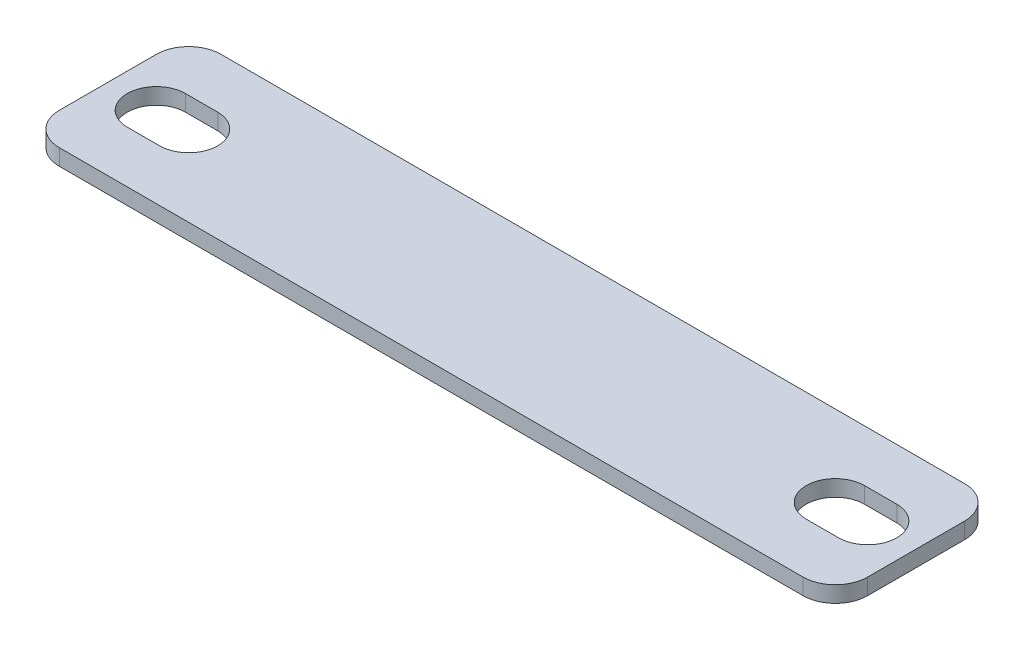
ISO-10303-21;
HEADER;
FILE_DESCRIPTION(('STEP AP214'),'2;1');
FILE_NAME('part.step','',(''),(''),'','','');
FILE_SCHEMA(('AUTOMOTIVE_DESIGN { 1 0 10303 214 1 1 1 1 }'));
ENDSEC;
DATA;
#1=APPLICATION_CONTEXT('core data for automotive mechanical design processes');
#2=APPLICATION_PROTOCOL_DEFINITION('international standard','automotive_design',2000,#1);
#3=PRODUCT_CONTEXT('',#1,'mechanical');
#4=PRODUCT('Part','Part','',(#3));
#5=PRODUCT_RELATED_PRODUCT_CATEGORY('part','',(#4));
#6=PRODUCT_DEFINITION_FORMATION('','',#4);
#7=PRODUCT_DEFINITION_CONTEXT('part definition',#1,'design');
#8=PRODUCT_DEFINITION('design','',#6,#7);
#9=PRODUCT_DEFINITION_SHAPE('','',#8);
#10=(LENGTH_UNIT() NAMED_UNIT(*) SI_UNIT(.MILLI.,.METRE.));
#11=(NAMED_UNIT(*) PLANE_ANGLE_UNIT() SI_UNIT($,.RADIAN.));
#12=(NAMED_UNIT(*) SI_UNIT($,.STERADIAN.) SOLID_ANGLE_UNIT());
#13=UNCERTAINTY_MEASURE_WITH_UNIT(LENGTH_MEASURE(1.E-05),#10,'distance_accuracy_value','');
#14=(GEOMETRIC_REPRESENTATION_CONTEXT(3) GLOBAL_UNCERTAINTY_ASSIGNED_CONTEXT((#13)) GLOBAL_UNIT_ASSIGNED_CONTEXT((#10,
#11,#12)) REPRESENTATION_CONTEXT('',''));
#15=CARTESIAN_POINT('',(0.,0.,0.));
#16=DIRECTION('',(0.,0.,1.));
#17=DIRECTION('',(1.,0.,0.));
#18=AXIS2_PLACEMENT_3D('',#15,#16,#17);
#19=CARTESIAN_POINT('',(0.,1.27,0.));
#20=DIRECTION('',(0.,-1.,0.));
#21=DIRECTION('',(0.,0.,-1.));
#22=AXIS2_PLACEMENT_3D('',#19,#20,#21);
#23=PLANE('',#22);
#24=CARTESIAN_POINT('',(-27.94,1.27,0.));
#25=DIRECTION('',(0.,1.,0.));
#26=DIRECTION('',(0.,0.,1.));
#27=AXIS2_PLACEMENT_3D('',#24,#25,#26);
#28=CIRCLE('',#27,2.286);
#29=CARTESIAN_POINT('',(-27.94,1.27,-2.286));
#30=VERTEX_POINT('',#29);
#31=CARTESIAN_POINT('',(-27.94,1.27,2.286));
#32=VERTEX_POINT('',#31);
#33=EDGE_CURVE('E215',#30,#32,#28,.T.);
#34=ORIENTED_EDGE('',*,*,#33,.F.);
#35=DIRECTION('',(-1.,0.,0.));
#36=VECTOR('',#35,1.);
#37=CARTESIAN_POINT('',(-27.94,1.27,-2.286));
#38=LINE('',#37,#36);
#39=CARTESIAN_POINT('',(-25.4,1.27,-2.286));
#40=VERTEX_POINT('',#39);
#41=EDGE_CURVE('E220',#40,#30,#38,.T.);
#42=ORIENTED_EDGE('',*,*,#41,.F.);
#43=CARTESIAN_POINT('',(-25.4,1.27,0.));
#44=DIRECTION('',(0.,1.,0.));
#45=DIRECTION('',(0.,0.,1.));
#46=AXIS2_PLACEMENT_3D('',#43,#44,#45);
#47=CIRCLE('',#46,2.286);
#48=CARTESIAN_POINT('',(-25.4,1.27,2.286));
#49=VERTEX_POINT('',#48);
#50=EDGE_CURVE('E214',#49,#40,#47,.T.);
#51=ORIENTED_EDGE('',*,*,#50,.F.);
#52=DIRECTION('',(1.,0.,0.));
#53=VECTOR('',#52,1.);
#54=CARTESIAN_POINT('',(-27.94,1.27,2.286));
#55=LINE('',#54,#53);
#56=EDGE_CURVE('E211',#32,#49,#55,.T.);
#57=ORIENTED_EDGE('',*,*,#56,.F.);
#58=EDGE_LOOP('',(#34,#42,#51,#57));
#59=FACE_BOUND('',#58,.T.);
#60=DIRECTION('',(0.,0.,-1.));
#61=VECTOR('',#60,1.);
#62=CARTESIAN_POINT('',(31.75,1.27,6.35));
#63=LINE('',#62,#61);
#64=CARTESIAN_POINT('',(31.75,1.27,3.81));
#65=VERTEX_POINT('',#64);
#66=CARTESIAN_POINT('',(31.75,1.27,-3.81));
#67=VERTEX_POINT('',#66);
#68=EDGE_CURVE('E195',#65,#67,#63,.T.);
#69=ORIENTED_EDGE('',*,*,#68,.T.);
#70=CARTESIAN_POINT('',(29.21,1.27,-3.81));
#71=DIRECTION('',(0.,-1.,0.));
#72=DIRECTION('',(0.,0.,-1.));
#73=AXIS2_PLACEMENT_3D('',#70,#71,#72);
#74=CIRCLE('',#73,2.54);
#75=CARTESIAN_POINT('',(29.21,1.27,-6.35));
#76=VERTEX_POINT('',#75);
#77=EDGE_CURVE('E282',#67,#76,#74,.F.);
#78=ORIENTED_EDGE('',*,*,#77,.T.);
#79=DIRECTION('',(-1.,0.,0.));
#80=VECTOR('',#79,1.);
#81=CARTESIAN_POINT('',(-31.75,1.27,-6.35));
#82=LINE('',#81,#80);
#83=CARTESIAN_POINT('',(-29.21,1.27,-6.35));
#84=VERTEX_POINT('',#83);
#85=EDGE_CURVE('E202',#76,#84,#82,.T.);
#86=ORIENTED_EDGE('',*,*,#85,.T.);
#87=CARTESIAN_POINT('',(-29.21,1.27,-3.81));
#88=DIRECTION('',(0.,-1.,0.));
#89=DIRECTION('',(0.,0.,-1.));
#90=AXIS2_PLACEMENT_3D('',#87,#88,#89);
#91=CIRCLE('',#90,2.54);
#92=CARTESIAN_POINT('',(-31.75,1.27,-3.81));
#93=VERTEX_POINT('',#92);
#94=EDGE_CURVE('E278',#84,#93,#91,.F.);
#95=ORIENTED_EDGE('',*,*,#94,.T.);
#96=DIRECTION('',(0.,0.,1.));
#97=VECTOR('',#96,1.);
#98=CARTESIAN_POINT('',(-31.75,1.27,6.35));
#99=LINE('',#98,#97);
#100=CARTESIAN_POINT('',(-31.75,1.27,3.81));
#101=VERTEX_POINT('',#100);
#102=EDGE_CURVE('E196',#93,#101,#99,.T.);
#103=ORIENTED_EDGE('',*,*,#102,.T.);
#104=CARTESIAN_POINT('',(-29.21,1.27,3.81));
#105=DIRECTION('',(0.,-1.,0.));
#106=DIRECTION('',(0.,0.,-1.));
#107=AXIS2_PLACEMENT_3D('',#104,#105,#106);
#108=CIRCLE('',#107,2.54);
#109=CARTESIAN_POINT('',(-29.21,1.27,6.35));
#110=VERTEX_POINT('',#109);
#111=EDGE_CURVE('E59',#101,#110,#108,.F.);
#112=ORIENTED_EDGE('',*,*,#111,.T.);
#113=DIRECTION('',(1.,0.,0.));
#114=VECTOR('',#113,1.);
#115=CARTESIAN_POINT('',(-31.75,1.27,6.35));
#116=LINE('',#115,#114);
#117=CARTESIAN_POINT('',(29.21,1.27,6.35));
#118=VERTEX_POINT('',#117);
#119=EDGE_CURVE('E192',#110,#118,#116,.T.);
#120=ORIENTED_EDGE('',*,*,#119,.T.);
#121=CARTESIAN_POINT('',(29.21,1.27,3.81));
#122=DIRECTION('',(0.,-1.,0.));
#123=DIRECTION('',(0.,0.,-1.));
#124=AXIS2_PLACEMENT_3D('',#121,#122,#123);
#125=CIRCLE('',#124,2.54);
#126=EDGE_CURVE('E280',#118,#65,#125,.F.);
#127=ORIENTED_EDGE('',*,*,#126,.T.);
#128=EDGE_LOOP('',(#69,#78,#86,#95,#103,#112,#120,#127));
#129=FACE_BOUND('',#128,.T.);
#130=CARTESIAN_POINT('',(25.4,1.27,0.));
#131=DIRECTION('',(0.,1.,0.));
#132=DIRECTION('',(0.,0.,1.));
#133=AXIS2_PLACEMENT_3D('',#130,#131,#132);
#134=CIRCLE('',#133,2.286);
#135=CARTESIAN_POINT('',(25.4,1.27,-2.286));
#136=VERTEX_POINT('',#135);
#137=CARTESIAN_POINT('',(25.4,1.27,2.286));
#138=VERTEX_POINT('',#137);
#139=EDGE_CURVE('E153',#136,#138,#134,.T.);
#140=ORIENTED_EDGE('',*,*,#139,.F.);
#141=DIRECTION('',(-1.,0.,0.));
#142=VECTOR('',#141,1.);
#143=CARTESIAN_POINT('',(25.4,1.27,-2.286));
#144=LINE('',#143,#142);
#145=CARTESIAN_POINT('',(27.94,1.27,-2.286));
#146=VERTEX_POINT('',#145);
#147=EDGE_CURVE('E177',#146,#136,#144,.T.);
#148=ORIENTED_EDGE('',*,*,#147,.F.);
#149=CARTESIAN_POINT('',(27.94,1.27,0.));
#150=DIRECTION('',(0.,1.,0.));
#151=DIRECTION('',(0.,0.,1.));
#152=AXIS2_PLACEMENT_3D('',#149,#150,#151);
#153=CIRCLE('',#152,2.286);
#154=CARTESIAN_POINT('',(27.94,1.27,2.286));
#155=VERTEX_POINT('',#154);
#156=EDGE_CURVE('E176',#155,#146,#153,.T.);
#157=ORIENTED_EDGE('',*,*,#156,.F.);
#158=DIRECTION('',(1.,0.,0.));
#159=VECTOR('',#158,1.);
#160=CARTESIAN_POINT('',(25.4,1.27,2.286));
#161=LINE('',#160,#159);
#162=EDGE_CURVE('E163',#138,#155,#161,.T.);
#163=ORIENTED_EDGE('',*,*,#162,.F.);
#164=EDGE_LOOP('',(#140,#148,#157,#163));
#165=FACE_BOUND('',#164,.T.);
#166=ADVANCED_FACE('F37',(#59,#129,#165),#23,.F.);
#167=CARTESIAN_POINT('',(0.,0.,0.));
#168=DIRECTION('',(0.,-1.,0.));
#169=DIRECTION('',(0.,0.,-1.));
#170=AXIS2_PLACEMENT_3D('',#167,#168,#169);
#171=PLANE('',#170);
#172=DIRECTION('',(-1.,0.,0.));
#173=VECTOR('',#172,1.);
#174=CARTESIAN_POINT('',(-31.75,0.,-6.35));
#175=LINE('',#174,#173);
#176=CARTESIAN_POINT('',(29.21,0.,-6.35));
#177=VERTEX_POINT('',#176);
#178=CARTESIAN_POINT('',(-29.21,0.,-6.35));
#179=VERTEX_POINT('',#178);
#180=EDGE_CURVE('E256',#177,#179,#175,.T.);
#181=ORIENTED_EDGE('',*,*,#180,.F.);
#182=CARTESIAN_POINT('',(29.21,0.,-3.81));
#183=DIRECTION('',(0.,-1.,0.));
#184=DIRECTION('',(0.,0.,-1.));
#185=AXIS2_PLACEMENT_3D('',#182,#183,#184);
#186=CIRCLE('',#185,2.54);
#187=CARTESIAN_POINT('',(31.75,0.,-3.81));
#188=VERTEX_POINT('',#187);
#189=EDGE_CURVE('E270',#177,#188,#186,.T.);
#190=ORIENTED_EDGE('',*,*,#189,.T.);
#191=DIRECTION('',(0.,0.,-1.));
#192=VECTOR('',#191,1.);
#193=CARTESIAN_POINT('',(31.75,0.,6.35));
#194=LINE('',#193,#192);
#195=CARTESIAN_POINT('',(31.75,0.,3.81));
#196=VERTEX_POINT('',#195);
#197=EDGE_CURVE('E251',#196,#188,#194,.T.);
#198=ORIENTED_EDGE('',*,*,#197,.F.);
#199=CARTESIAN_POINT('',(29.21,0.,3.81));
#200=DIRECTION('',(0.,-1.,0.));
#201=DIRECTION('',(0.,0.,-1.));
#202=AXIS2_PLACEMENT_3D('',#199,#200,#201);
#203=CIRCLE('',#202,2.54);
#204=CARTESIAN_POINT('',(29.21,0.,6.35));
#205=VERTEX_POINT('',#204);
#206=EDGE_CURVE('E268',#196,#205,#203,.T.);
#207=ORIENTED_EDGE('',*,*,#206,.T.);
#208=DIRECTION('',(1.,0.,0.));
#209=VECTOR('',#208,1.);
#210=CARTESIAN_POINT('',(-31.75,0.,6.35));
#211=LINE('',#210,#209);
#212=CARTESIAN_POINT('',(-29.21,0.,6.35));
#213=VERTEX_POINT('',#212);
#214=EDGE_CURVE('E247',#213,#205,#211,.T.);
#215=ORIENTED_EDGE('',*,*,#214,.F.);
#216=CARTESIAN_POINT('',(-29.21,0.,3.81));
#217=DIRECTION('',(0.,-1.,0.));
#218=DIRECTION('',(0.,0.,-1.));
#219=AXIS2_PLACEMENT_3D('',#216,#217,#218);
#220=CIRCLE('',#219,2.54);
#221=CARTESIAN_POINT('',(-31.75,0.,3.81));
#222=VERTEX_POINT('',#221);
#223=EDGE_CURVE('E264',#213,#222,#220,.T.);
#224=ORIENTED_EDGE('',*,*,#223,.T.);
#225=DIRECTION('',(0.,0.,1.));
#226=VECTOR('',#225,1.);
#227=CARTESIAN_POINT('',(-31.75,0.,6.35));
#228=LINE('',#227,#226);
#229=CARTESIAN_POINT('',(-31.75,0.,-3.81));
#230=VERTEX_POINT('',#229);
#231=EDGE_CURVE('E243',#230,#222,#228,.T.);
#232=ORIENTED_EDGE('',*,*,#231,.F.);
#233=CARTESIAN_POINT('',(-29.21,0.,-3.81));
#234=DIRECTION('',(0.,-1.,0.));
#235=DIRECTION('',(0.,0.,-1.));
#236=AXIS2_PLACEMENT_3D('',#233,#234,#235);
#237=CIRCLE('',#236,2.54);
#238=EDGE_CURVE('E266',#230,#179,#237,.T.);
#239=ORIENTED_EDGE('',*,*,#238,.T.);
#240=EDGE_LOOP('',(#181,#190,#198,#207,#215,#224,#232,#239));
#241=FACE_BOUND('',#240,.T.);
#242=DIRECTION('',(-1.,0.,0.));
#243=VECTOR('',#242,1.);
#244=CARTESIAN_POINT('',(-27.94,0.,-2.286));
#245=LINE('',#244,#243);
#246=CARTESIAN_POINT('',(-25.4,0.,-2.286));
#247=VERTEX_POINT('',#246);
#248=CARTESIAN_POINT('',(-27.94,0.,-2.286));
#249=VERTEX_POINT('',#248);
#250=EDGE_CURVE('E233',#247,#249,#245,.T.);
#251=ORIENTED_EDGE('',*,*,#250,.T.);
#252=CARTESIAN_POINT('',(-27.94,0.,0.));
#253=DIRECTION('',(0.,1.,0.));
#254=DIRECTION('',(0.,0.,1.));
#255=AXIS2_PLACEMENT_3D('',#252,#253,#254);
#256=CIRCLE('',#255,2.286);
#257=CARTESIAN_POINT('',(-27.94,0.,2.286));
#258=VERTEX_POINT('',#257);
#259=EDGE_CURVE('E171',#249,#258,#256,.T.);
#260=ORIENTED_EDGE('',*,*,#259,.T.);
#261=DIRECTION('',(1.,0.,0.));
#262=VECTOR('',#261,1.);
#263=CARTESIAN_POINT('',(-27.94,0.,2.286));
#264=LINE('',#263,#262);
#265=CARTESIAN_POINT('',(-25.4,0.,2.286));
#266=VERTEX_POINT('',#265);
#267=EDGE_CURVE('E227',#258,#266,#264,.T.);
#268=ORIENTED_EDGE('',*,*,#267,.T.);
#269=CARTESIAN_POINT('',(-25.4,0.,0.));
#270=DIRECTION('',(0.,1.,0.));
#271=DIRECTION('',(0.,0.,1.));
#272=AXIS2_PLACEMENT_3D('',#269,#270,#271);
#273=CIRCLE('',#272,2.286);
#274=EDGE_CURVE('E230',#266,#247,#273,.T.);
#275=ORIENTED_EDGE('',*,*,#274,.T.);
#276=EDGE_LOOP('',(#251,#260,#268,#275));
#277=FACE_BOUND('',#276,.T.);
#278=DIRECTION('',(-1.,0.,0.));
#279=VECTOR('',#278,1.);
#280=CARTESIAN_POINT('',(25.4,0.,-2.286));
#281=LINE('',#280,#279);
#282=CARTESIAN_POINT('',(27.94,0.,-2.286));
#283=VERTEX_POINT('',#282);
#284=CARTESIAN_POINT('',(25.4,0.,-2.286));
#285=VERTEX_POINT('',#284);
#286=EDGE_CURVE('E164',#283,#285,#281,.T.);
#287=ORIENTED_EDGE('',*,*,#286,.T.);
#288=CARTESIAN_POINT('',(25.4,0.,0.));
#289=DIRECTION('',(0.,1.,0.));
#290=DIRECTION('',(0.,0.,1.));
#291=AXIS2_PLACEMENT_3D('',#288,#289,#290);
#292=CIRCLE('',#291,2.286);
#293=CARTESIAN_POINT('',(25.4,0.,2.286));
#294=VERTEX_POINT('',#293);
#295=EDGE_CURVE('E387',#285,#294,#292,.T.);
#296=ORIENTED_EDGE('',*,*,#295,.T.);
#297=DIRECTION('',(1.,0.,0.));
#298=VECTOR('',#297,1.);
#299=CARTESIAN_POINT('',(25.4,0.,2.286));
#300=LINE('',#299,#298);
#301=CARTESIAN_POINT('',(27.94,0.,2.286));
#302=VERTEX_POINT('',#301);
#303=EDGE_CURVE('E170',#294,#302,#300,.T.);
#304=ORIENTED_EDGE('',*,*,#303,.T.);
#305=CARTESIAN_POINT('',(27.94,0.,0.));
#306=DIRECTION('',(0.,1.,0.));
#307=DIRECTION('',(0.,0.,1.));
#308=AXIS2_PLACEMENT_3D('',#305,#306,#307);
#309=CIRCLE('',#308,2.286);
#310=EDGE_CURVE('E389',#302,#283,#309,.T.);
#311=ORIENTED_EDGE('',*,*,#310,.T.);
#312=EDGE_LOOP('',(#287,#296,#304,#311));
#313=FACE_BOUND('',#312,.T.);
#314=ADVANCED_FACE('F298',(#241,#277,#313),#171,.T.);
#315=CARTESIAN_POINT('',(-31.75,1.27,6.35));
#316=DIRECTION('',(1.,0.,0.));
#317=DIRECTION('',(0.,0.,-1.));
#318=AXIS2_PLACEMENT_3D('',#315,#316,#317);
#319=PLANE('',#318);
#320=ORIENTED_EDGE('',*,*,#102,.F.);
#321=DIRECTION('',(0.,-1.,0.));
#322=VECTOR('',#321,1.);
#323=CARTESIAN_POINT('',(-31.75,1.27,-3.81));
#324=LINE('',#323,#322);
#325=EDGE_CURVE('E12',#93,#230,#324,.T.);
#326=ORIENTED_EDGE('',*,*,#325,.T.);
#327=ORIENTED_EDGE('',*,*,#231,.T.);
#328=DIRECTION('',(0.,-1.,0.));
#329=VECTOR('',#328,1.);
#330=CARTESIAN_POINT('',(-31.75,1.27,3.81));
#331=LINE('',#330,#329);
#332=EDGE_CURVE('E45',#222,#101,#331,.F.);
#333=ORIENTED_EDGE('',*,*,#332,.T.);
#334=EDGE_LOOP('',(#320,#326,#327,#333));
#335=FACE_BOUND('',#334,.T.);
#336=ADVANCED_FACE('F288',(#335),#319,.F.);
#337=CARTESIAN_POINT('',(-31.75,1.27,6.35));
#338=DIRECTION('',(0.,0.,-1.));
#339=DIRECTION('',(-1.,0.,0.));
#340=AXIS2_PLACEMENT_3D('',#337,#338,#339);
#341=PLANE('',#340);
#342=ORIENTED_EDGE('',*,*,#214,.T.);
#343=DIRECTION('',(0.,-1.,0.));
#344=VECTOR('',#343,1.);
#345=CARTESIAN_POINT('',(29.21,1.27,6.35));
#346=LINE('',#345,#344);
#347=EDGE_CURVE('E52',#205,#118,#346,.F.);
#348=ORIENTED_EDGE('',*,*,#347,.T.);
#349=ORIENTED_EDGE('',*,*,#119,.F.);
#350=DIRECTION('',(0.,-1.,0.));
#351=VECTOR('',#350,1.);
#352=CARTESIAN_POINT('',(-29.21,1.27,6.35));
#353=LINE('',#352,#351);
#354=EDGE_CURVE('E284',#110,#213,#353,.T.);
#355=ORIENTED_EDGE('',*,*,#354,.T.);
#356=EDGE_LOOP('',(#342,#348,#349,#355));
#357=FACE_BOUND('',#356,.T.);
#358=ADVANCED_FACE('F295',(#357),#341,.F.);
#359=CARTESIAN_POINT('',(31.75,1.27,6.35));
#360=DIRECTION('',(-1.,0.,0.));
#361=DIRECTION('',(0.,0.,1.));
#362=AXIS2_PLACEMENT_3D('',#359,#360,#361);
#363=PLANE('',#362);
#364=ORIENTED_EDGE('',*,*,#197,.T.);
#365=DIRECTION('',(0.,-1.,0.));
#366=VECTOR('',#365,1.);
#367=CARTESIAN_POINT('',(31.75,1.27,-3.81));
#368=LINE('',#367,#366);
#369=EDGE_CURVE('E275',#188,#67,#368,.F.);
#370=ORIENTED_EDGE('',*,*,#369,.T.);
#371=ORIENTED_EDGE('',*,*,#68,.F.);
#372=DIRECTION('',(0.,-1.,0.));
#373=VECTOR('',#372,1.);
#374=CARTESIAN_POINT('',(31.75,1.27,3.81));
#375=LINE('',#374,#373);
#376=EDGE_CURVE('E272',#65,#196,#375,.T.);
#377=ORIENTED_EDGE('',*,*,#376,.T.);
#378=EDGE_LOOP('',(#364,#370,#371,#377));
#379=FACE_BOUND('',#378,.T.);
#380=ADVANCED_FACE('F307',(#379),#363,.F.);
#381=CARTESIAN_POINT('',(-31.75,1.27,-6.35));
#382=DIRECTION('',(0.,0.,1.));
#383=DIRECTION('',(1.,0.,0.));
#384=AXIS2_PLACEMENT_3D('',#381,#382,#383);
#385=PLANE('',#384);
#386=ORIENTED_EDGE('',*,*,#85,.F.);
#387=DIRECTION('',(0.,-1.,0.));
#388=VECTOR('',#387,1.);
#389=CARTESIAN_POINT('',(29.21,1.27,-6.35));
#390=LINE('',#389,#388);
#391=EDGE_CURVE('E261',#76,#177,#390,.T.);
#392=ORIENTED_EDGE('',*,*,#391,.T.);
#393=ORIENTED_EDGE('',*,*,#180,.T.);
#394=DIRECTION('',(0.,-1.,0.));
#395=VECTOR('',#394,1.);
#396=CARTESIAN_POINT('',(-29.21,1.27,-6.35));
#397=LINE('',#396,#395);
#398=EDGE_CURVE('E259',#179,#84,#397,.F.);
#399=ORIENTED_EDGE('',*,*,#398,.T.);
#400=EDGE_LOOP('',(#386,#392,#393,#399));
#401=FACE_BOUND('',#400,.T.);
#402=ADVANCED_FACE('F315',(#401),#385,.F.);
#403=CARTESIAN_POINT('',(-27.94,1.27,0.));
#404=DIRECTION('',(0.,-1.,0.));
#405=DIRECTION('',(0.,0.,-1.));
#406=AXIS2_PLACEMENT_3D('',#403,#404,#405);
#407=CYLINDRICAL_SURFACE('',#406,2.286);
#408=ORIENTED_EDGE('',*,*,#259,.F.);
#409=DIRECTION('',(0.,-1.,0.));
#410=VECTOR('',#409,1.);
#411=CARTESIAN_POINT('',(-27.94,1.27,-2.286));
#412=LINE('',#411,#410);
#413=EDGE_CURVE('E223',#30,#249,#412,.T.);
#414=ORIENTED_EDGE('',*,*,#413,.F.);
#415=ORIENTED_EDGE('',*,*,#33,.T.);
#416=DIRECTION('',(0.,-1.,0.));
#417=VECTOR('',#416,1.);
#418=CARTESIAN_POINT('',(-27.94,1.27,2.286));
#419=LINE('',#418,#417);
#420=EDGE_CURVE('E241',#32,#258,#419,.T.);
#421=ORIENTED_EDGE('',*,*,#420,.T.);
#422=EDGE_LOOP('',(#408,#414,#415,#421));
#423=FACE_BOUND('',#422,.T.);
#424=ADVANCED_FACE('F334',(#423),#407,.F.);
#425=CARTESIAN_POINT('',(-27.94,1.27,2.286));
#426=DIRECTION('',(0.,0.,-1.));
#427=DIRECTION('',(-1.,0.,0.));
#428=AXIS2_PLACEMENT_3D('',#425,#426,#427);
#429=PLANE('',#428);
#430=ORIENTED_EDGE('',*,*,#267,.F.);
#431=ORIENTED_EDGE('',*,*,#420,.F.);
#432=ORIENTED_EDGE('',*,*,#56,.T.);
#433=DIRECTION('',(0.,-1.,0.));
#434=VECTOR('',#433,1.);
#435=CARTESIAN_POINT('',(-25.4,1.27,2.286));
#436=LINE('',#435,#434);
#437=EDGE_CURVE('E240',#49,#266,#436,.T.);
#438=ORIENTED_EDGE('',*,*,#437,.T.);
#439=EDGE_LOOP('',(#430,#431,#432,#438));
#440=FACE_BOUND('',#439,.T.);
#441=ADVANCED_FACE('F370',(#440),#429,.T.);
#442=CARTESIAN_POINT('',(-25.4,1.27,0.));
#443=DIRECTION('',(0.,-1.,0.));
#444=DIRECTION('',(0.,0.,-1.));
#445=AXIS2_PLACEMENT_3D('',#442,#443,#444);
#446=CYLINDRICAL_SURFACE('',#445,2.286);
#447=ORIENTED_EDGE('',*,*,#274,.F.);
#448=ORIENTED_EDGE('',*,*,#437,.F.);
#449=ORIENTED_EDGE('',*,*,#50,.T.);
#450=DIRECTION('',(0.,-1.,0.));
#451=VECTOR('',#450,1.);
#452=CARTESIAN_POINT('',(-25.4,1.27,-2.286));
#453=LINE('',#452,#451);
#454=EDGE_CURVE('E238',#40,#247,#453,.T.);
#455=ORIENTED_EDGE('',*,*,#454,.T.);
#456=EDGE_LOOP('',(#447,#448,#449,#455));
#457=FACE_BOUND('',#456,.T.);
#458=ADVANCED_FACE('F367',(#457),#446,.F.);
#459=CARTESIAN_POINT('',(-27.94,1.27,-2.286));
#460=DIRECTION('',(0.,0.,1.));
#461=DIRECTION('',(1.,0.,0.));
#462=AXIS2_PLACEMENT_3D('',#459,#460,#461);
#463=PLANE('',#462);
#464=ORIENTED_EDGE('',*,*,#250,.F.);
#465=ORIENTED_EDGE('',*,*,#454,.F.);
#466=ORIENTED_EDGE('',*,*,#41,.T.);
#467=ORIENTED_EDGE('',*,*,#413,.T.);
#468=EDGE_LOOP('',(#464,#465,#466,#467));
#469=FACE_BOUND('',#468,.T.);
#470=ADVANCED_FACE('F364',(#469),#463,.T.);
#471=CARTESIAN_POINT('',(25.4,1.27,0.));
#472=DIRECTION('',(0.,-1.,0.));
#473=DIRECTION('',(0.,0.,-1.));
#474=AXIS2_PLACEMENT_3D('',#471,#472,#473);
#475=CYLINDRICAL_SURFACE('',#474,2.286);
#476=ORIENTED_EDGE('',*,*,#295,.F.);
#477=DIRECTION('',(0.,-1.,0.));
#478=VECTOR('',#477,1.);
#479=CARTESIAN_POINT('',(25.4,1.27,-2.286));
#480=LINE('',#479,#478);
#481=EDGE_CURVE('E159',#136,#285,#480,.T.);
#482=ORIENTED_EDGE('',*,*,#481,.F.);
#483=ORIENTED_EDGE('',*,*,#139,.T.);
#484=DIRECTION('',(0.,-1.,0.));
#485=VECTOR('',#484,1.);
#486=CARTESIAN_POINT('',(25.4,1.27,2.286));
#487=LINE('',#486,#485);
#488=EDGE_CURVE('E156',#138,#294,#487,.T.);
#489=ORIENTED_EDGE('',*,*,#488,.T.);
#490=EDGE_LOOP('',(#476,#482,#483,#489));
#491=FACE_BOUND('',#490,.T.);
#492=ADVANCED_FACE('F155',(#491),#475,.F.);
#493=CARTESIAN_POINT('',(25.4,1.27,2.286));
#494=DIRECTION('',(0.,0.,-1.));
#495=DIRECTION('',(-1.,0.,0.));
#496=AXIS2_PLACEMENT_3D('',#493,#494,#495);
#497=PLANE('',#496);
#498=ORIENTED_EDGE('',*,*,#303,.F.);
#499=ORIENTED_EDGE('',*,*,#488,.F.);
#500=ORIENTED_EDGE('',*,*,#162,.T.);
#501=DIRECTION('',(0.,-1.,0.));
#502=VECTOR('',#501,1.);
#503=CARTESIAN_POINT('',(27.94,1.27,2.286));
#504=LINE('',#503,#502);
#505=EDGE_CURVE('E172',#155,#302,#504,.T.);
#506=ORIENTED_EDGE('',*,*,#505,.T.);
#507=EDGE_LOOP('',(#498,#499,#500,#506));
#508=FACE_BOUND('',#507,.T.);
#509=ADVANCED_FACE('F167',(#508),#497,.T.);
#510=CARTESIAN_POINT('',(27.94,1.27,0.));
#511=DIRECTION('',(0.,-1.,0.));
#512=DIRECTION('',(0.,0.,-1.));
#513=AXIS2_PLACEMENT_3D('',#510,#511,#512);
#514=CYLINDRICAL_SURFACE('',#513,2.286);
#515=ORIENTED_EDGE('',*,*,#310,.F.);
#516=ORIENTED_EDGE('',*,*,#505,.F.);
#517=ORIENTED_EDGE('',*,*,#156,.T.);
#518=DIRECTION('',(0.,-1.,0.));
#519=VECTOR('',#518,1.);
#520=CARTESIAN_POINT('',(27.94,1.27,-2.286));
#521=LINE('',#520,#519);
#522=EDGE_CURVE('E395',#146,#283,#521,.T.);
#523=ORIENTED_EDGE('',*,*,#522,.T.);
#524=EDGE_LOOP('',(#515,#516,#517,#523));
#525=FACE_BOUND('',#524,.T.);
#526=ADVANCED_FACE('F350',(#525),#514,.F.);
#527=CARTESIAN_POINT('',(25.4,1.27,-2.286));
#528=DIRECTION('',(0.,0.,1.));
#529=DIRECTION('',(1.,0.,0.));
#530=AXIS2_PLACEMENT_3D('',#527,#528,#529);
#531=PLANE('',#530);
#532=ORIENTED_EDGE('',*,*,#286,.F.);
#533=ORIENTED_EDGE('',*,*,#522,.F.);
#534=ORIENTED_EDGE('',*,*,#147,.T.);
#535=ORIENTED_EDGE('',*,*,#481,.T.);
#536=EDGE_LOOP('',(#532,#533,#534,#535));
#537=FACE_BOUND('',#536,.T.);
#538=ADVANCED_FACE('F346',(#537),#531,.T.);
#539=CARTESIAN_POINT('',(29.21,1.27,-3.81));
#540=DIRECTION('',(0.,-1.,0.));
#541=DIRECTION('',(0.,0.,-1.));
#542=AXIS2_PLACEMENT_3D('',#539,#540,#541);
#543=CYLINDRICAL_SURFACE('',#542,2.54);
#544=ORIENTED_EDGE('',*,*,#77,.F.);
#545=ORIENTED_EDGE('',*,*,#369,.F.);
#546=ORIENTED_EDGE('',*,*,#189,.F.);
#547=ORIENTED_EDGE('',*,*,#391,.F.);
#548=EDGE_LOOP('',(#544,#545,#546,#547));
#549=FACE_BOUND('',#548,.T.);
#550=ADVANCED_FACE('F313',(#549),#543,.T.);
#551=CARTESIAN_POINT('',(29.21,1.27,3.81));
#552=DIRECTION('',(0.,-1.,0.));
#553=DIRECTION('',(0.,0.,-1.));
#554=AXIS2_PLACEMENT_3D('',#551,#552,#553);
#555=CYLINDRICAL_SURFACE('',#554,2.54);
#556=ORIENTED_EDGE('',*,*,#126,.F.);
#557=ORIENTED_EDGE('',*,*,#347,.F.);
#558=ORIENTED_EDGE('',*,*,#206,.F.);
#559=ORIENTED_EDGE('',*,*,#376,.F.);
#560=EDGE_LOOP('',(#556,#557,#558,#559));
#561=FACE_BOUND('',#560,.T.);
#562=ADVANCED_FACE('F304',(#561),#555,.T.);
#563=CARTESIAN_POINT('',(-29.21,1.27,-3.81));
#564=DIRECTION('',(0.,-1.,0.));
#565=DIRECTION('',(0.,0.,-1.));
#566=AXIS2_PLACEMENT_3D('',#563,#564,#565);
#567=CYLINDRICAL_SURFACE('',#566,2.54);
#568=ORIENTED_EDGE('',*,*,#94,.F.);
#569=ORIENTED_EDGE('',*,*,#398,.F.);
#570=ORIENTED_EDGE('',*,*,#238,.F.);
#571=ORIENTED_EDGE('',*,*,#325,.F.);
#572=EDGE_LOOP('',(#568,#569,#570,#571));
#573=FACE_BOUND('',#572,.T.);
#574=ADVANCED_FACE('F318',(#573),#567,.T.);
#575=CARTESIAN_POINT('',(-29.21,1.27,3.81));
#576=DIRECTION('',(0.,-1.,0.));
#577=DIRECTION('',(0.,0.,-1.));
#578=AXIS2_PLACEMENT_3D('',#575,#576,#577);
#579=CYLINDRICAL_SURFACE('',#578,2.54);
#580=ORIENTED_EDGE('',*,*,#111,.F.);
#581=ORIENTED_EDGE('',*,*,#332,.F.);
#582=ORIENTED_EDGE('',*,*,#223,.F.);
#583=ORIENTED_EDGE('',*,*,#354,.F.);
#584=EDGE_LOOP('',(#580,#581,#582,#583));
#585=FACE_BOUND('',#584,.T.);
#586=ADVANCED_FACE('F39',(#585),#579,.T.);
#587=CLOSED_SHELL('',(#166,#314,#336,#358,#380,#402,#424,#441,#458,#470,#492,#509,#526,#538,
#550,#562,#574,#586));
#588=MANIFOLD_SOLID_BREP('B2',#587);
#589=ADVANCED_BREP_SHAPE_REPRESENTATION('',(#18,#588),#14);
#590=SHAPE_DEFINITION_REPRESENTATION(#9,#589);
ENDSEC;
END-ISO-10303-21;
